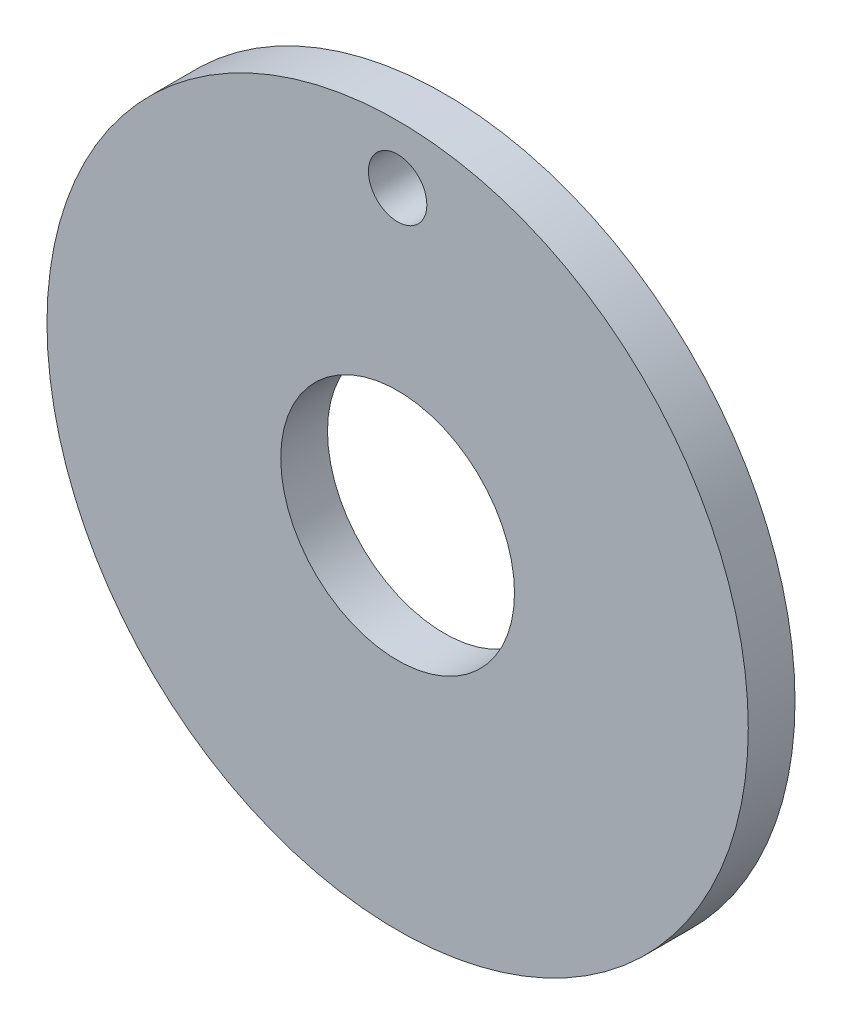
ISO-10303-21;
HEADER;
FILE_DESCRIPTION(('STEP AP214'),'2;1');
FILE_NAME('part.step','',(''),(''),'','','');
FILE_SCHEMA(('AUTOMOTIVE_DESIGN { 1 0 10303 214 1 1 1 1 }'));
ENDSEC;
DATA;
#1=APPLICATION_CONTEXT('core data for automotive mechanical design processes');
#2=APPLICATION_PROTOCOL_DEFINITION('international standard','automotive_design',2000,#1);
#3=PRODUCT_CONTEXT('',#1,'mechanical');
#4=PRODUCT('Part','Part','',(#3));
#5=PRODUCT_RELATED_PRODUCT_CATEGORY('part','',(#4));
#6=PRODUCT_DEFINITION_FORMATION('','',#4);
#7=PRODUCT_DEFINITION_CONTEXT('part definition',#1,'design');
#8=PRODUCT_DEFINITION('design','',#6,#7);
#9=PRODUCT_DEFINITION_SHAPE('','',#8);
#10=(LENGTH_UNIT() NAMED_UNIT(*) SI_UNIT(.MILLI.,.METRE.));
#11=(NAMED_UNIT(*) PLANE_ANGLE_UNIT() SI_UNIT($,.RADIAN.));
#12=(NAMED_UNIT(*) SI_UNIT($,.STERADIAN.) SOLID_ANGLE_UNIT());
#13=UNCERTAINTY_MEASURE_WITH_UNIT(LENGTH_MEASURE(1.E-05),#10,'distance_accuracy_value','');
#14=(GEOMETRIC_REPRESENTATION_CONTEXT(3) GLOBAL_UNCERTAINTY_ASSIGNED_CONTEXT((#13)) GLOBAL_UNIT_ASSIGNED_CONTEXT((#10,
#11,#12)) REPRESENTATION_CONTEXT('',''));
#15=CARTESIAN_POINT('',(0.,0.,0.));
#16=DIRECTION('',(0.,0.,1.));
#17=DIRECTION('',(1.,0.,0.));
#18=AXIS2_PLACEMENT_3D('',#15,#16,#17);
#19=CARTESIAN_POINT('',(0.,0.,2.54));
#20=DIRECTION('',(0.,0.,1.));
#21=DIRECTION('',(1.,0.,0.));
#22=AXIS2_PLACEMENT_3D('',#19,#20,#21);
#23=PLANE('',#22);
#24=CARTESIAN_POINT('',(0.,15.875,2.54));
#25=DIRECTION('',(0.,0.,1.));
#26=DIRECTION('',(1.,0.,0.));
#27=AXIS2_PLACEMENT_3D('',#24,#25,#26);
#28=CIRCLE('',#27,1.5875);
#29=CARTESIAN_POINT('',(1.5875,15.875,2.54));
#30=VERTEX_POINT('',#29);
#31=EDGE_CURVE('E50',#30,#30,#28,.T.);
#32=ORIENTED_EDGE('',*,*,#31,.F.);
#33=EDGE_LOOP('',(#32));
#34=FACE_BOUND('',#33,.T.);
#35=CARTESIAN_POINT('',(0.,0.,2.54));
#36=DIRECTION('',(0.,0.,1.));
#37=DIRECTION('',(1.,0.,0.));
#38=AXIS2_PLACEMENT_3D('',#35,#36,#37);
#39=CIRCLE('',#38,19.05);
#40=CARTESIAN_POINT('',(19.05,0.,2.54));
#41=VERTEX_POINT('',#40);
#42=EDGE_CURVE('E10',#41,#41,#39,.T.);
#43=ORIENTED_EDGE('',*,*,#42,.T.);
#44=EDGE_LOOP('',(#43));
#45=FACE_BOUND('',#44,.T.);
#46=CARTESIAN_POINT('',(0.,0.,2.54));
#47=DIRECTION('',(0.,0.,1.));
#48=DIRECTION('',(1.,0.,0.));
#49=AXIS2_PLACEMENT_3D('',#46,#47,#48);
#50=CIRCLE('',#49,6.35);
#51=CARTESIAN_POINT('',(6.35,0.,2.54));
#52=VERTEX_POINT('',#51);
#53=EDGE_CURVE('E42',#52,#52,#50,.T.);
#54=ORIENTED_EDGE('',*,*,#53,.F.);
#55=EDGE_LOOP('',(#54));
#56=FACE_BOUND('',#55,.T.);
#57=ADVANCED_FACE('F31',(#34,#45,#56),#23,.T.);
#58=CARTESIAN_POINT('',(0.,0.,0.));
#59=DIRECTION('',(0.,0.,1.));
#60=DIRECTION('',(1.,0.,0.));
#61=AXIS2_PLACEMENT_3D('',#58,#59,#60);
#62=PLANE('',#61);
#63=CARTESIAN_POINT('',(0.,15.875,0.));
#64=DIRECTION('',(0.,0.,1.));
#65=DIRECTION('',(1.,0.,0.));
#66=AXIS2_PLACEMENT_3D('',#63,#64,#65);
#67=CIRCLE('',#66,1.5875);
#68=CARTESIAN_POINT('',(1.5875,15.875,0.));
#69=VERTEX_POINT('',#68);
#70=EDGE_CURVE('E47',#69,#69,#67,.T.);
#71=ORIENTED_EDGE('',*,*,#70,.T.);
#72=EDGE_LOOP('',(#71));
#73=FACE_BOUND('',#72,.T.);
#74=CARTESIAN_POINT('',(0.,0.,0.));
#75=DIRECTION('',(0.,0.,1.));
#76=DIRECTION('',(1.,0.,0.));
#77=AXIS2_PLACEMENT_3D('',#74,#75,#76);
#78=CIRCLE('',#77,19.05);
#79=CARTESIAN_POINT('',(19.05,0.,0.));
#80=VERTEX_POINT('',#79);
#81=EDGE_CURVE('E35',#80,#80,#78,.T.);
#82=ORIENTED_EDGE('',*,*,#81,.F.);
#83=EDGE_LOOP('',(#82));
#84=FACE_BOUND('',#83,.T.);
#85=CARTESIAN_POINT('',(0.,0.,0.));
#86=DIRECTION('',(0.,0.,1.));
#87=DIRECTION('',(1.,0.,0.));
#88=AXIS2_PLACEMENT_3D('',#85,#86,#87);
#89=CIRCLE('',#88,6.35);
#90=CARTESIAN_POINT('',(6.35,0.,0.));
#91=VERTEX_POINT('',#90);
#92=EDGE_CURVE('E44',#91,#91,#89,.T.);
#93=ORIENTED_EDGE('',*,*,#92,.T.);
#94=EDGE_LOOP('',(#93));
#95=FACE_BOUND('',#94,.T.);
#96=ADVANCED_FACE('F56',(#73,#84,#95),#62,.F.);
#97=CARTESIAN_POINT('',(0.,0.,2.54));
#98=DIRECTION('',(0.,0.,-1.));
#99=DIRECTION('',(-1.,0.,0.));
#100=AXIS2_PLACEMENT_3D('',#97,#98,#99);
#101=CYLINDRICAL_SURFACE('',#100,19.05);
#102=ORIENTED_EDGE('',*,*,#42,.F.);
#103=EDGE_LOOP('',(#102));
#104=FACE_BOUND('',#103,.T.);
#105=ORIENTED_EDGE('',*,*,#81,.T.);
#106=EDGE_LOOP('',(#105));
#107=FACE_BOUND('',#106,.T.);
#108=ADVANCED_FACE('F33',(#104,#107),#101,.T.);
#109=CARTESIAN_POINT('',(0.,0.,2.54));
#110=DIRECTION('',(0.,0.,-1.));
#111=DIRECTION('',(-1.,0.,0.));
#112=AXIS2_PLACEMENT_3D('',#109,#110,#111);
#113=CYLINDRICAL_SURFACE('',#112,6.35);
#114=ORIENTED_EDGE('',*,*,#53,.T.);
#115=EDGE_LOOP('',(#114));
#116=FACE_BOUND('',#115,.T.);
#117=ORIENTED_EDGE('',*,*,#92,.F.);
#118=EDGE_LOOP('',(#117));
#119=FACE_BOUND('',#118,.T.);
#120=ADVANCED_FACE('F62',(#116,#119),#113,.F.);
#121=CARTESIAN_POINT('',(0.,15.875,0.));
#122=DIRECTION('',(0.,0.,1.));
#123=DIRECTION('',(1.,0.,0.));
#124=AXIS2_PLACEMENT_3D('',#121,#122,#123);
#125=CYLINDRICAL_SURFACE('',#124,1.5875);
#126=ORIENTED_EDGE('',*,*,#70,.F.);
#127=EDGE_LOOP('',(#126));
#128=FACE_BOUND('',#127,.T.);
#129=ORIENTED_EDGE('',*,*,#31,.T.);
#130=EDGE_LOOP('',(#129));
#131=FACE_BOUND('',#130,.T.);
#132=ADVANCED_FACE('F59',(#128,#131),#125,.F.);
#133=CLOSED_SHELL('',(#57,#96,#108,#120,#132));
#134=MANIFOLD_SOLID_BREP('B2',#133);
#135=ADVANCED_BREP_SHAPE_REPRESENTATION('',(#18,#134),#14);
#136=SHAPE_DEFINITION_REPRESENTATION(#9,#135);
ENDSEC;
END-ISO-10303-21;
